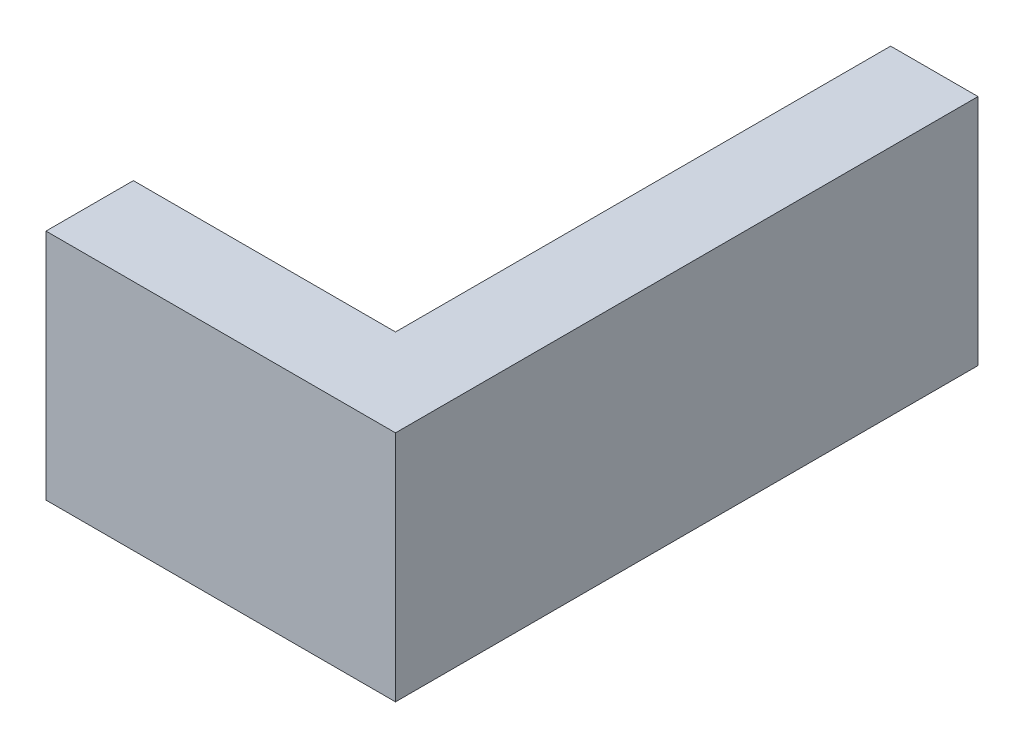
ISO-10303-21;
HEADER;
FILE_DESCRIPTION(('STEP AP214'),'2;1');
FILE_NAME('part.step','',(''),(''),'','','');
FILE_SCHEMA(('AUTOMOTIVE_DESIGN { 1 0 10303 214 1 1 1 1 }'));
ENDSEC;
DATA;
#1=APPLICATION_CONTEXT('core data for automotive mechanical design processes');
#2=APPLICATION_PROTOCOL_DEFINITION('international standard','automotive_design',2000,#1);
#3=PRODUCT_CONTEXT('',#1,'mechanical');
#4=PRODUCT('Part','Part','',(#3));
#5=PRODUCT_RELATED_PRODUCT_CATEGORY('part','',(#4));
#6=PRODUCT_DEFINITION_FORMATION('','',#4);
#7=PRODUCT_DEFINITION_CONTEXT('part definition',#1,'design');
#8=PRODUCT_DEFINITION('design','',#6,#7);
#9=PRODUCT_DEFINITION_SHAPE('','',#8);
#10=(LENGTH_UNIT() NAMED_UNIT(*) SI_UNIT(.MILLI.,.METRE.));
#11=(NAMED_UNIT(*) PLANE_ANGLE_UNIT() SI_UNIT($,.RADIAN.));
#12=(NAMED_UNIT(*) SI_UNIT($,.STERADIAN.) SOLID_ANGLE_UNIT());
#13=UNCERTAINTY_MEASURE_WITH_UNIT(LENGTH_MEASURE(1.E-05),#10,'distance_accuracy_value','');
#14=(GEOMETRIC_REPRESENTATION_CONTEXT(3) GLOBAL_UNCERTAINTY_ASSIGNED_CONTEXT((#13)) GLOBAL_UNIT_ASSIGNED_CONTEXT((#10,
#11,#12)) REPRESENTATION_CONTEXT('',''));
#15=CARTESIAN_POINT('',(0.,0.,0.));
#16=DIRECTION('',(0.,0.,1.));
#17=DIRECTION('',(1.,0.,0.));
#18=AXIS2_PLACEMENT_3D('',#15,#16,#17);
#19=CARTESIAN_POINT('',(57.15,25.4,0.));
#20=DIRECTION('',(-1.,0.,0.));
#21=DIRECTION('',(0.,0.,1.));
#22=AXIS2_PLACEMENT_3D('',#19,#20,#21);
#23=PLANE('',#22);
#24=DIRECTION('',(0.,0.,-1.));
#25=VECTOR('',#24,1.);
#26=CARTESIAN_POINT('',(57.15,-25.4,0.));
#27=LINE('',#26,#25);
#28=CARTESIAN_POINT('',(57.15,-25.4,-19.05));
#29=VERTEX_POINT('',#28);
#30=CARTESIAN_POINT('',(57.15,-25.4,-127.));
#31=VERTEX_POINT('',#30);
#32=EDGE_CURVE('E126',#29,#31,#27,.T.);
#33=ORIENTED_EDGE('',*,*,#32,.F.);
#34=DIRECTION('',(0.,-1.,0.));
#35=VECTOR('',#34,1.);
#36=CARTESIAN_POINT('',(57.15,25.4,-19.05));
#37=LINE('',#36,#35);
#38=CARTESIAN_POINT('',(57.15,25.4,-19.05));
#39=VERTEX_POINT('',#38);
#40=EDGE_CURVE('E11',#39,#29,#37,.T.);
#41=ORIENTED_EDGE('',*,*,#40,.F.);
#42=DIRECTION('',(0.,0.,-1.));
#43=VECTOR('',#42,1.);
#44=CARTESIAN_POINT('',(57.15,25.4,0.));
#45=LINE('',#44,#43);
#46=CARTESIAN_POINT('',(57.15,25.4,-127.));
#47=VERTEX_POINT('',#46);
#48=EDGE_CURVE('E145',#39,#47,#45,.T.);
#49=ORIENTED_EDGE('',*,*,#48,.T.);
#50=DIRECTION('',(0.,-1.,0.));
#51=VECTOR('',#50,1.);
#52=CARTESIAN_POINT('',(57.15,25.4,-127.));
#53=LINE('',#52,#51);
#54=EDGE_CURVE('E87',#47,#31,#53,.T.);
#55=ORIENTED_EDGE('',*,*,#54,.T.);
#56=EDGE_LOOP('',(#33,#41,#49,#55));
#57=FACE_BOUND('',#56,.T.);
#58=ADVANCED_FACE('F41',(#57),#23,.T.);
#59=CARTESIAN_POINT('',(0.,25.4,-19.05));
#60=DIRECTION('',(0.,0.,-1.));
#61=DIRECTION('',(-1.,0.,0.));
#62=AXIS2_PLACEMENT_3D('',#59,#60,#61);
#63=PLANE('',#62);
#64=DIRECTION('',(1.,0.,0.));
#65=VECTOR('',#64,1.);
#66=CARTESIAN_POINT('',(0.,-25.4,-19.05));
#67=LINE('',#66,#65);
#68=CARTESIAN_POINT('',(0.,-25.4,-19.05));
#69=VERTEX_POINT('',#68);
#70=EDGE_CURVE('E130',#69,#29,#67,.T.);
#71=ORIENTED_EDGE('',*,*,#70,.F.);
#72=DIRECTION('',(0.,-1.,0.));
#73=VECTOR('',#72,1.);
#74=CARTESIAN_POINT('',(0.,25.4,-19.05));
#75=LINE('',#74,#73);
#76=CARTESIAN_POINT('',(0.,25.4,-19.05));
#77=VERTEX_POINT('',#76);
#78=EDGE_CURVE('E50',#77,#69,#75,.T.);
#79=ORIENTED_EDGE('',*,*,#78,.F.);
#80=DIRECTION('',(1.,0.,0.));
#81=VECTOR('',#80,1.);
#82=CARTESIAN_POINT('',(0.,25.4,-19.05));
#83=LINE('',#82,#81);
#84=EDGE_CURVE('E165',#77,#39,#83,.T.);
#85=ORIENTED_EDGE('',*,*,#84,.T.);
#86=ORIENTED_EDGE('',*,*,#40,.T.);
#87=EDGE_LOOP('',(#71,#79,#85,#86));
#88=FACE_BOUND('',#87,.T.);
#89=ADVANCED_FACE('F158',(#88),#63,.T.);
#90=CARTESIAN_POINT('',(0.,25.4,0.));
#91=DIRECTION('',(-1.,0.,0.));
#92=DIRECTION('',(0.,0.,1.));
#93=AXIS2_PLACEMENT_3D('',#90,#91,#92);
#94=PLANE('',#93);
#95=DIRECTION('',(0.,0.,-1.));
#96=VECTOR('',#95,1.);
#97=CARTESIAN_POINT('',(0.,-25.4,0.));
#98=LINE('',#97,#96);
#99=CARTESIAN_POINT('',(0.,-25.4,0.));
#100=VERTEX_POINT('',#99);
#101=EDGE_CURVE('E134',#100,#69,#98,.T.);
#102=ORIENTED_EDGE('',*,*,#101,.F.);
#103=DIRECTION('',(0.,-1.,0.));
#104=VECTOR('',#103,1.);
#105=CARTESIAN_POINT('',(0.,25.4,0.));
#106=LINE('',#105,#104);
#107=CARTESIAN_POINT('',(0.,25.4,0.));
#108=VERTEX_POINT('',#107);
#109=EDGE_CURVE('E116',#108,#100,#106,.T.);
#110=ORIENTED_EDGE('',*,*,#109,.F.);
#111=DIRECTION('',(0.,0.,-1.));
#112=VECTOR('',#111,1.);
#113=CARTESIAN_POINT('',(0.,25.4,0.));
#114=LINE('',#113,#112);
#115=EDGE_CURVE('E107',#108,#77,#114,.T.);
#116=ORIENTED_EDGE('',*,*,#115,.T.);
#117=ORIENTED_EDGE('',*,*,#78,.T.);
#118=EDGE_LOOP('',(#102,#110,#116,#117));
#119=FACE_BOUND('',#118,.T.);
#120=ADVANCED_FACE('F155',(#119),#94,.T.);
#121=CARTESIAN_POINT('',(0.,25.4,0.));
#122=DIRECTION('',(0.,0.,-1.));
#123=DIRECTION('',(-1.,0.,0.));
#124=AXIS2_PLACEMENT_3D('',#121,#122,#123);
#125=PLANE('',#124);
#126=DIRECTION('',(1.,0.,0.));
#127=VECTOR('',#126,1.);
#128=CARTESIAN_POINT('',(0.,-25.4,0.));
#129=LINE('',#128,#127);
#130=CARTESIAN_POINT('',(76.2,-25.4,0.));
#131=VERTEX_POINT('',#130);
#132=EDGE_CURVE('E114',#100,#131,#129,.T.);
#133=ORIENTED_EDGE('',*,*,#132,.T.);
#134=DIRECTION('',(0.,-1.,0.));
#135=VECTOR('',#134,1.);
#136=CARTESIAN_POINT('',(76.2,25.4,0.));
#137=LINE('',#136,#135);
#138=CARTESIAN_POINT('',(76.2,25.4,0.));
#139=VERTEX_POINT('',#138);
#140=EDGE_CURVE('E111',#139,#131,#137,.T.);
#141=ORIENTED_EDGE('',*,*,#140,.F.);
#142=DIRECTION('',(1.,0.,0.));
#143=VECTOR('',#142,1.);
#144=CARTESIAN_POINT('',(0.,25.4,0.));
#145=LINE('',#144,#143);
#146=EDGE_CURVE('E100',#108,#139,#145,.T.);
#147=ORIENTED_EDGE('',*,*,#146,.F.);
#148=ORIENTED_EDGE('',*,*,#109,.T.);
#149=EDGE_LOOP('',(#133,#141,#147,#148));
#150=FACE_BOUND('',#149,.T.);
#151=ADVANCED_FACE('F112',(#150),#125,.F.);
#152=CARTESIAN_POINT('',(76.2,25.4,0.));
#153=DIRECTION('',(-1.,0.,0.));
#154=DIRECTION('',(0.,0.,1.));
#155=AXIS2_PLACEMENT_3D('',#152,#153,#154);
#156=PLANE('',#155);
#157=DIRECTION('',(0.,0.,-1.));
#158=VECTOR('',#157,1.);
#159=CARTESIAN_POINT('',(76.2,-25.4,0.));
#160=LINE('',#159,#158);
#161=CARTESIAN_POINT('',(76.2,-25.4,-127.));
#162=VERTEX_POINT('',#161);
#163=EDGE_CURVE('E80',#131,#162,#160,.T.);
#164=ORIENTED_EDGE('',*,*,#163,.T.);
#165=DIRECTION('',(0.,-1.,0.));
#166=VECTOR('',#165,1.);
#167=CARTESIAN_POINT('',(76.2,25.4,-127.));
#168=LINE('',#167,#166);
#169=CARTESIAN_POINT('',(76.2,25.4,-127.));
#170=VERTEX_POINT('',#169);
#171=EDGE_CURVE('E117',#170,#162,#168,.T.);
#172=ORIENTED_EDGE('',*,*,#171,.F.);
#173=DIRECTION('',(0.,0.,-1.));
#174=VECTOR('',#173,1.);
#175=CARTESIAN_POINT('',(76.2,25.4,0.));
#176=LINE('',#175,#174);
#177=EDGE_CURVE('E104',#139,#170,#176,.T.);
#178=ORIENTED_EDGE('',*,*,#177,.F.);
#179=ORIENTED_EDGE('',*,*,#140,.T.);
#180=EDGE_LOOP('',(#164,#172,#178,#179));
#181=FACE_BOUND('',#180,.T.);
#182=ADVANCED_FACE('F119',(#181),#156,.F.);
#183=CARTESIAN_POINT('',(0.,25.4,-127.));
#184=DIRECTION('',(0.,0.,1.));
#185=DIRECTION('',(1.,0.,0.));
#186=AXIS2_PLACEMENT_3D('',#183,#184,#185);
#187=PLANE('',#186);
#188=DIRECTION('',(-1.,0.,0.));
#189=VECTOR('',#188,1.);
#190=CARTESIAN_POINT('',(0.,-25.4,-127.));
#191=LINE('',#190,#189);
#192=EDGE_CURVE('E142',#162,#31,#191,.T.);
#193=ORIENTED_EDGE('',*,*,#192,.T.);
#194=ORIENTED_EDGE('',*,*,#54,.F.);
#195=DIRECTION('',(-1.,0.,0.));
#196=VECTOR('',#195,1.);
#197=CARTESIAN_POINT('',(0.,25.4,-127.));
#198=LINE('',#197,#196);
#199=EDGE_CURVE('E58',#170,#47,#198,.T.);
#200=ORIENTED_EDGE('',*,*,#199,.F.);
#201=ORIENTED_EDGE('',*,*,#171,.T.);
#202=EDGE_LOOP('',(#193,#194,#200,#201));
#203=FACE_BOUND('',#202,.T.);
#204=ADVANCED_FACE('F163',(#203),#187,.F.);
#205=CARTESIAN_POINT('',(0.,25.4,0.));
#206=DIRECTION('',(0.,1.,0.));
#207=DIRECTION('',(0.,0.,1.));
#208=AXIS2_PLACEMENT_3D('',#205,#206,#207);
#209=PLANE('',#208);
#210=ORIENTED_EDGE('',*,*,#48,.F.);
#211=ORIENTED_EDGE('',*,*,#84,.F.);
#212=ORIENTED_EDGE('',*,*,#115,.F.);
#213=ORIENTED_EDGE('',*,*,#146,.T.);
#214=ORIENTED_EDGE('',*,*,#177,.T.);
#215=ORIENTED_EDGE('',*,*,#199,.T.);
#216=EDGE_LOOP('',(#210,#211,#212,#213,#214,#215));
#217=FACE_BOUND('',#216,.T.);
#218=ADVANCED_FACE('F102',(#217),#209,.T.);
#219=CARTESIAN_POINT('',(0.,-25.4,0.));
#220=DIRECTION('',(0.,1.,0.));
#221=DIRECTION('',(0.,0.,1.));
#222=AXIS2_PLACEMENT_3D('',#219,#220,#221);
#223=PLANE('',#222);
#224=ORIENTED_EDGE('',*,*,#32,.T.);
#225=ORIENTED_EDGE('',*,*,#192,.F.);
#226=ORIENTED_EDGE('',*,*,#163,.F.);
#227=ORIENTED_EDGE('',*,*,#132,.F.);
#228=ORIENTED_EDGE('',*,*,#101,.T.);
#229=ORIENTED_EDGE('',*,*,#70,.T.);
#230=EDGE_LOOP('',(#224,#225,#226,#227,#228,#229));
#231=FACE_BOUND('',#230,.T.);
#232=ADVANCED_FACE('F160',(#231),#223,.F.);
#233=CLOSED_SHELL('',(#58,#89,#120,#151,#182,#204,#218,#232));
#234=MANIFOLD_SOLID_BREP('B2',#233);
#235=ADVANCED_BREP_SHAPE_REPRESENTATION('',(#18,#234),#14);
#236=SHAPE_DEFINITION_REPRESENTATION(#9,#235);
ENDSEC;
END-ISO-10303-21;
